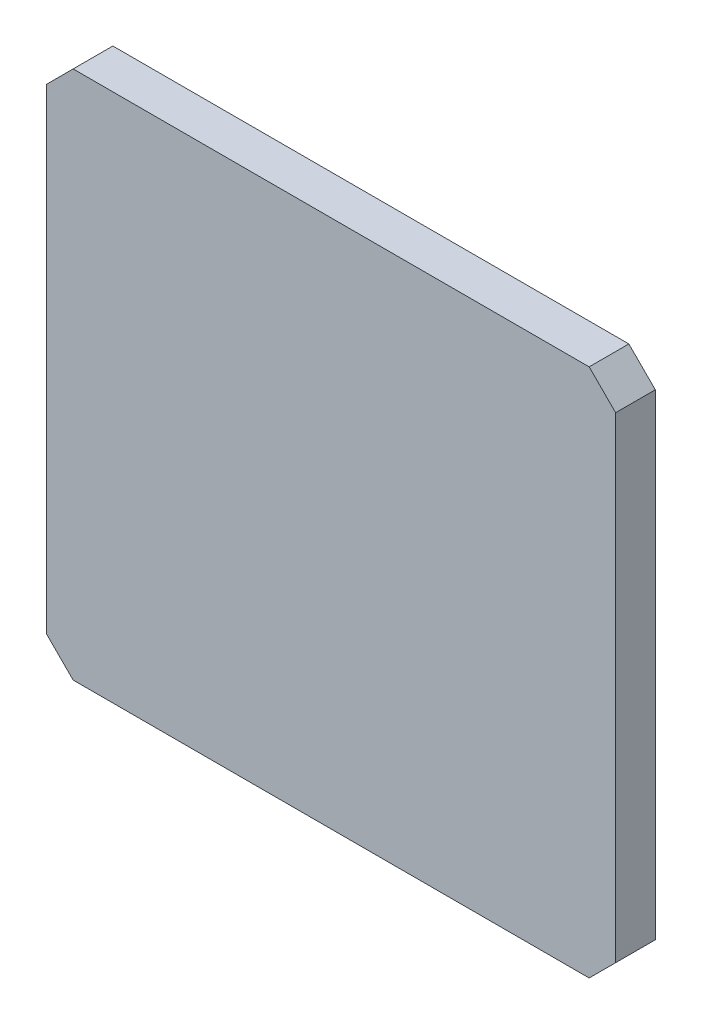
ISO-10303-21;
HEADER;
FILE_DESCRIPTION(('STEP AP214'),'2;1');
FILE_NAME('part.step','',(''),(''),'','','');
FILE_SCHEMA(('AUTOMOTIVE_DESIGN { 1 0 10303 214 1 1 1 1 }'));
ENDSEC;
DATA;
#1=APPLICATION_CONTEXT('core data for automotive mechanical design processes');
#2=APPLICATION_PROTOCOL_DEFINITION('international standard','automotive_design',2000,#1);
#3=PRODUCT_CONTEXT('',#1,'mechanical');
#4=PRODUCT('Part','Part','',(#3));
#5=PRODUCT_RELATED_PRODUCT_CATEGORY('part','',(#4));
#6=PRODUCT_DEFINITION_FORMATION('','',#4);
#7=PRODUCT_DEFINITION_CONTEXT('part definition',#1,'design');
#8=PRODUCT_DEFINITION('design','',#6,#7);
#9=PRODUCT_DEFINITION_SHAPE('','',#8);
#10=(LENGTH_UNIT() NAMED_UNIT(*) SI_UNIT(.MILLI.,.METRE.));
#11=(NAMED_UNIT(*) PLANE_ANGLE_UNIT() SI_UNIT($,.RADIAN.));
#12=(NAMED_UNIT(*) SI_UNIT($,.STERADIAN.) SOLID_ANGLE_UNIT());
#13=UNCERTAINTY_MEASURE_WITH_UNIT(LENGTH_MEASURE(1.E-05),#10,'distance_accuracy_value','');
#14=(GEOMETRIC_REPRESENTATION_CONTEXT(3) GLOBAL_UNCERTAINTY_ASSIGNED_CONTEXT((#13)) GLOBAL_UNIT_ASSIGNED_CONTEXT((#10,
#11,#12)) REPRESENTATION_CONTEXT('',''));
#15=CARTESIAN_POINT('',(0.,0.,0.));
#16=DIRECTION('',(0.,0.,1.));
#17=DIRECTION('',(1.,0.,0.));
#18=AXIS2_PLACEMENT_3D('',#15,#16,#17);
#19=CARTESIAN_POINT('',(33.5,7.5,5.));
#20=DIRECTION('',(0.,0.,-1.));
#21=DIRECTION('',(-1.,0.,0.));
#22=AXIS2_PLACEMENT_3D('',#19,#20,#21);
#23=PLANE('',#22);
#24=DIRECTION('',(0.707106781186548,0.707106781186548,0.));
#25=VECTOR('',#24,1.);
#26=CARTESIAN_POINT('',(-5.5,7.5,5.));
#27=LINE('',#26,#25);
#28=CARTESIAN_POINT('',(-5.5,7.5,5.));
#29=VERTEX_POINT('',#28);
#30=CARTESIAN_POINT('',(-7.5,5.5,5.));
#31=VERTEX_POINT('',#30);
#32=EDGE_CURVE('E116',#29,#31,#27,.F.);
#33=ORIENTED_EDGE('',*,*,#32,.T.);
#34=DIRECTION('',(0.,1.,0.));
#35=VECTOR('',#34,1.);
#36=CARTESIAN_POINT('',(-7.5,5.5,5.));
#37=LINE('',#36,#35);
#38=CARTESIAN_POINT('',(-7.5,-30.5,5.));
#39=VERTEX_POINT('',#38);
#40=EDGE_CURVE('E112',#31,#39,#37,.F.);
#41=ORIENTED_EDGE('',*,*,#40,.T.);
#42=DIRECTION('',(-0.707106781186548,0.707106781186548,0.));
#43=VECTOR('',#42,1.);
#44=CARTESIAN_POINT('',(-7.5,-30.5,5.));
#45=LINE('',#44,#43);
#46=CARTESIAN_POINT('',(-5.5,-32.5,5.));
#47=VERTEX_POINT('',#46);
#48=EDGE_CURVE('E108',#39,#47,#45,.F.);
#49=ORIENTED_EDGE('',*,*,#48,.T.);
#50=DIRECTION('',(1.,0.,0.));
#51=VECTOR('',#50,1.);
#52=CARTESIAN_POINT('',(-5.5,-32.5,5.));
#53=LINE('',#52,#51);
#54=CARTESIAN_POINT('',(33.5,-32.5,5.));
#55=VERTEX_POINT('',#54);
#56=EDGE_CURVE('E104',#47,#55,#53,.T.);
#57=ORIENTED_EDGE('',*,*,#56,.T.);
#58=DIRECTION('',(-0.707106781186548,-0.707106781186548,0.));
#59=VECTOR('',#58,1.);
#60=CARTESIAN_POINT('',(33.5,-32.5,5.));
#61=LINE('',#60,#59);
#62=CARTESIAN_POINT('',(35.5,-30.5,5.));
#63=VERTEX_POINT('',#62);
#64=EDGE_CURVE('E80',#55,#63,#61,.F.);
#65=ORIENTED_EDGE('',*,*,#64,.T.);
#66=DIRECTION('',(0.,1.,0.));
#67=VECTOR('',#66,1.);
#68=CARTESIAN_POINT('',(35.5,-30.5,5.));
#69=LINE('',#68,#67);
#70=CARTESIAN_POINT('',(35.5,5.5,5.));
#71=VERTEX_POINT('',#70);
#72=EDGE_CURVE('E82',#63,#71,#69,.T.);
#73=ORIENTED_EDGE('',*,*,#72,.T.);
#74=DIRECTION('',(0.707106781186548,-0.707106781186548,0.));
#75=VECTOR('',#74,1.);
#76=CARTESIAN_POINT('',(35.5,5.5,5.));
#77=LINE('',#76,#75);
#78=CARTESIAN_POINT('',(33.5,7.5,5.));
#79=VERTEX_POINT('',#78);
#80=EDGE_CURVE('E20',#71,#79,#77,.F.);
#81=ORIENTED_EDGE('',*,*,#80,.T.);
#82=DIRECTION('',(1.,0.,0.));
#83=VECTOR('',#82,1.);
#84=CARTESIAN_POINT('',(33.5,7.5,5.));
#85=LINE('',#84,#83);
#86=EDGE_CURVE('E121',#79,#29,#85,.F.);
#87=ORIENTED_EDGE('',*,*,#86,.T.);
#88=EDGE_LOOP('',(#33,#41,#49,#57,#65,#73,#81,#87));
#89=FACE_BOUND('',#88,.T.);
#90=ADVANCED_FACE('F17',(#89),#23,.F.);
#91=CARTESIAN_POINT('',(35.5,5.5,2.));
#92=DIRECTION('',(-0.707106781186548,-0.707106781186548,0.));
#93=DIRECTION('',(0.707106781186548,-0.707106781186548,0.));
#94=AXIS2_PLACEMENT_3D('',#91,#92,#93);
#95=PLANE('',#94);
#96=DIRECTION('',(0.,0.,-1.));
#97=VECTOR('',#96,1.);
#98=CARTESIAN_POINT('',(33.5,7.5,2.));
#99=LINE('',#98,#97);
#100=CARTESIAN_POINT('',(33.5,7.5,2.));
#101=VERTEX_POINT('',#100);
#102=EDGE_CURVE('E93',#101,#79,#99,.F.);
#103=ORIENTED_EDGE('',*,*,#102,.T.);
#104=ORIENTED_EDGE('',*,*,#80,.F.);
#105=DIRECTION('',(0.,0.,1.));
#106=VECTOR('',#105,1.);
#107=CARTESIAN_POINT('',(35.5,5.5,2.));
#108=LINE('',#107,#106);
#109=CARTESIAN_POINT('',(35.5,5.5,2.));
#110=VERTEX_POINT('',#109);
#111=EDGE_CURVE('E88',#71,#110,#108,.F.);
#112=ORIENTED_EDGE('',*,*,#111,.T.);
#113=DIRECTION('',(0.707106781186548,-0.707106781186547,0.));
#114=VECTOR('',#113,1.);
#115=CARTESIAN_POINT('',(33.5,7.5,2.));
#116=LINE('',#115,#114);
#117=EDGE_CURVE('E124',#101,#110,#116,.T.);
#118=ORIENTED_EDGE('',*,*,#117,.F.);
#119=EDGE_LOOP('',(#103,#104,#112,#118));
#120=FACE_BOUND('',#119,.T.);
#121=ADVANCED_FACE('F90',(#120),#95,.F.);
#122=CARTESIAN_POINT('',(35.5,-30.5,2.));
#123=DIRECTION('',(-1.,0.,0.));
#124=DIRECTION('',(0.,0.,1.));
#125=AXIS2_PLACEMENT_3D('',#122,#123,#124);
#126=PLANE('',#125);
#127=ORIENTED_EDGE('',*,*,#111,.F.);
#128=ORIENTED_EDGE('',*,*,#72,.F.);
#129=DIRECTION('',(0.,0.,1.));
#130=VECTOR('',#129,1.);
#131=CARTESIAN_POINT('',(35.5,-30.5,2.));
#132=LINE('',#131,#130);
#133=CARTESIAN_POINT('',(35.5,-30.5,2.));
#134=VERTEX_POINT('',#133);
#135=EDGE_CURVE('E100',#63,#134,#132,.F.);
#136=ORIENTED_EDGE('',*,*,#135,.T.);
#137=DIRECTION('',(0.,1.,0.));
#138=VECTOR('',#137,1.);
#139=CARTESIAN_POINT('',(35.5,7.5,2.));
#140=LINE('',#139,#138);
#141=EDGE_CURVE('E97',#110,#134,#140,.F.);
#142=ORIENTED_EDGE('',*,*,#141,.F.);
#143=EDGE_LOOP('',(#127,#128,#136,#142));
#144=FACE_BOUND('',#143,.T.);
#145=ADVANCED_FACE('F95',(#144),#126,.F.);
#146=CARTESIAN_POINT('',(33.5,-32.5,2.));
#147=DIRECTION('',(-0.707106781186548,0.707106781186548,0.));
#148=DIRECTION('',(-0.707106781186548,-0.707106781186548,0.));
#149=AXIS2_PLACEMENT_3D('',#146,#147,#148);
#150=PLANE('',#149);
#151=ORIENTED_EDGE('',*,*,#135,.F.);
#152=ORIENTED_EDGE('',*,*,#64,.F.);
#153=DIRECTION('',(0.,0.,1.));
#154=VECTOR('',#153,1.);
#155=CARTESIAN_POINT('',(33.5,-32.5,2.));
#156=LINE('',#155,#154);
#157=CARTESIAN_POINT('',(33.5,-32.5,2.));
#158=VERTEX_POINT('',#157);
#159=EDGE_CURVE('E106',#55,#158,#156,.F.);
#160=ORIENTED_EDGE('',*,*,#159,.T.);
#161=DIRECTION('',(-0.707106781186547,-0.707106781186547,0.));
#162=VECTOR('',#161,1.);
#163=CARTESIAN_POINT('',(35.5,-30.5,2.));
#164=LINE('',#163,#162);
#165=EDGE_CURVE('E127',#134,#158,#164,.T.);
#166=ORIENTED_EDGE('',*,*,#165,.F.);
#167=EDGE_LOOP('',(#151,#152,#160,#166));
#168=FACE_BOUND('',#167,.T.);
#169=ADVANCED_FACE('F160',(#168),#150,.F.);
#170=CARTESIAN_POINT('',(-5.5,-32.5,2.));
#171=DIRECTION('',(0.,1.,0.));
#172=DIRECTION('',(0.,0.,1.));
#173=AXIS2_PLACEMENT_3D('',#170,#171,#172);
#174=PLANE('',#173);
#175=ORIENTED_EDGE('',*,*,#159,.F.);
#176=ORIENTED_EDGE('',*,*,#56,.F.);
#177=DIRECTION('',(0.,0.,1.));
#178=VECTOR('',#177,1.);
#179=CARTESIAN_POINT('',(-5.5,-32.5,2.));
#180=LINE('',#179,#178);
#181=CARTESIAN_POINT('',(-5.5,-32.5,2.));
#182=VERTEX_POINT('',#181);
#183=EDGE_CURVE('E110',#47,#182,#180,.F.);
#184=ORIENTED_EDGE('',*,*,#183,.T.);
#185=DIRECTION('',(-1.,0.,0.));
#186=VECTOR('',#185,1.);
#187=CARTESIAN_POINT('',(33.5,-32.5,2.));
#188=LINE('',#187,#186);
#189=EDGE_CURVE('E130',#158,#182,#188,.T.);
#190=ORIENTED_EDGE('',*,*,#189,.F.);
#191=EDGE_LOOP('',(#175,#176,#184,#190));
#192=FACE_BOUND('',#191,.T.);
#193=ADVANCED_FACE('F158',(#192),#174,.F.);
#194=CARTESIAN_POINT('',(-7.5,-30.5,2.));
#195=DIRECTION('',(0.707106781186548,0.707106781186548,0.));
#196=DIRECTION('',(-0.707106781186548,0.707106781186548,0.));
#197=AXIS2_PLACEMENT_3D('',#194,#195,#196);
#198=PLANE('',#197);
#199=ORIENTED_EDGE('',*,*,#183,.F.);
#200=ORIENTED_EDGE('',*,*,#48,.F.);
#201=DIRECTION('',(0.,0.,-1.));
#202=VECTOR('',#201,1.);
#203=CARTESIAN_POINT('',(-7.5,-30.5,2.));
#204=LINE('',#203,#202);
#205=CARTESIAN_POINT('',(-7.5,-30.5,2.));
#206=VERTEX_POINT('',#205);
#207=EDGE_CURVE('E114',#39,#206,#204,.T.);
#208=ORIENTED_EDGE('',*,*,#207,.T.);
#209=DIRECTION('',(-0.707106781186547,0.707106781186547,0.));
#210=VECTOR('',#209,1.);
#211=CARTESIAN_POINT('',(-5.5,-32.5,2.));
#212=LINE('',#211,#210);
#213=EDGE_CURVE('E133',#182,#206,#212,.T.);
#214=ORIENTED_EDGE('',*,*,#213,.F.);
#215=EDGE_LOOP('',(#199,#200,#208,#214));
#216=FACE_BOUND('',#215,.T.);
#217=ADVANCED_FACE('F153',(#216),#198,.F.);
#218=CARTESIAN_POINT('',(-7.5,5.5,2.));
#219=DIRECTION('',(1.,0.,0.));
#220=DIRECTION('',(0.,0.,-1.));
#221=AXIS2_PLACEMENT_3D('',#218,#219,#220);
#222=PLANE('',#221);
#223=ORIENTED_EDGE('',*,*,#207,.F.);
#224=ORIENTED_EDGE('',*,*,#40,.F.);
#225=DIRECTION('',(0.,0.,1.));
#226=VECTOR('',#225,1.);
#227=CARTESIAN_POINT('',(-7.5,5.5,2.));
#228=LINE('',#227,#226);
#229=CARTESIAN_POINT('',(-7.5,5.5,2.));
#230=VERTEX_POINT('',#229);
#231=EDGE_CURVE('E118',#31,#230,#228,.F.);
#232=ORIENTED_EDGE('',*,*,#231,.T.);
#233=DIRECTION('',(0.,1.,0.));
#234=VECTOR('',#233,1.);
#235=CARTESIAN_POINT('',(-7.5,7.5,2.));
#236=LINE('',#235,#234);
#237=EDGE_CURVE('E136',#206,#230,#236,.T.);
#238=ORIENTED_EDGE('',*,*,#237,.F.);
#239=EDGE_LOOP('',(#223,#224,#232,#238));
#240=FACE_BOUND('',#239,.T.);
#241=ADVANCED_FACE('F148',(#240),#222,.F.);
#242=CARTESIAN_POINT('',(-5.5,7.5,2.));
#243=DIRECTION('',(0.707106781186548,-0.707106781186548,0.));
#244=DIRECTION('',(0.707106781186548,0.707106781186548,0.));
#245=AXIS2_PLACEMENT_3D('',#242,#243,#244);
#246=PLANE('',#245);
#247=ORIENTED_EDGE('',*,*,#231,.F.);
#248=ORIENTED_EDGE('',*,*,#32,.F.);
#249=DIRECTION('',(0.,0.,-1.));
#250=VECTOR('',#249,1.);
#251=CARTESIAN_POINT('',(-5.5,7.5,2.));
#252=LINE('',#251,#250);
#253=CARTESIAN_POINT('',(-5.5,7.5,2.));
#254=VERTEX_POINT('',#253);
#255=EDGE_CURVE('E35',#29,#254,#252,.T.);
#256=ORIENTED_EDGE('',*,*,#255,.T.);
#257=DIRECTION('',(0.707106781186548,0.707106781186547,0.));
#258=VECTOR('',#257,1.);
#259=CARTESIAN_POINT('',(-7.5,5.5,2.));
#260=LINE('',#259,#258);
#261=EDGE_CURVE('E26',#230,#254,#260,.T.);
#262=ORIENTED_EDGE('',*,*,#261,.F.);
#263=EDGE_LOOP('',(#247,#248,#256,#262));
#264=FACE_BOUND('',#263,.T.);
#265=ADVANCED_FACE('F144',(#264),#246,.F.);
#266=CARTESIAN_POINT('',(33.5,7.5,2.));
#267=DIRECTION('',(0.,-1.,0.));
#268=DIRECTION('',(0.,0.,-1.));
#269=AXIS2_PLACEMENT_3D('',#266,#267,#268);
#270=PLANE('',#269);
#271=ORIENTED_EDGE('',*,*,#255,.F.);
#272=ORIENTED_EDGE('',*,*,#86,.F.);
#273=ORIENTED_EDGE('',*,*,#102,.F.);
#274=DIRECTION('',(-1.,0.,0.));
#275=VECTOR('',#274,1.);
#276=CARTESIAN_POINT('',(33.5,7.5,2.));
#277=LINE('',#276,#275);
#278=EDGE_CURVE('E11',#254,#101,#277,.F.);
#279=ORIENTED_EDGE('',*,*,#278,.F.);
#280=EDGE_LOOP('',(#271,#272,#273,#279));
#281=FACE_BOUND('',#280,.T.);
#282=ADVANCED_FACE('F163',(#281),#270,.F.);
#283=CARTESIAN_POINT('',(33.5,7.5,2.));
#284=DIRECTION('',(0.,0.,-1.));
#285=DIRECTION('',(-1.,0.,0.));
#286=AXIS2_PLACEMENT_3D('',#283,#284,#285);
#287=PLANE('',#286);
#288=ORIENTED_EDGE('',*,*,#261,.T.);
#289=ORIENTED_EDGE('',*,*,#278,.T.);
#290=ORIENTED_EDGE('',*,*,#117,.T.);
#291=ORIENTED_EDGE('',*,*,#141,.T.);
#292=ORIENTED_EDGE('',*,*,#165,.T.);
#293=ORIENTED_EDGE('',*,*,#189,.T.);
#294=ORIENTED_EDGE('',*,*,#213,.T.);
#295=ORIENTED_EDGE('',*,*,#237,.T.);
#296=EDGE_LOOP('',(#288,#289,#290,#291,#292,#293,#294,#295));
#297=FACE_BOUND('',#296,.T.);
#298=ADVANCED_FACE('F141',(#297),#287,.T.);
#299=CLOSED_SHELL('',(#90,#121,#145,#169,#193,#217,#241,#265,#282,#298));
#300=MANIFOLD_SOLID_BREP('B1',#299);
#301=ADVANCED_BREP_SHAPE_REPRESENTATION('',(#18,#300),#14);
#302=SHAPE_DEFINITION_REPRESENTATION(#9,#301);
ENDSEC;
END-ISO-10303-21;
